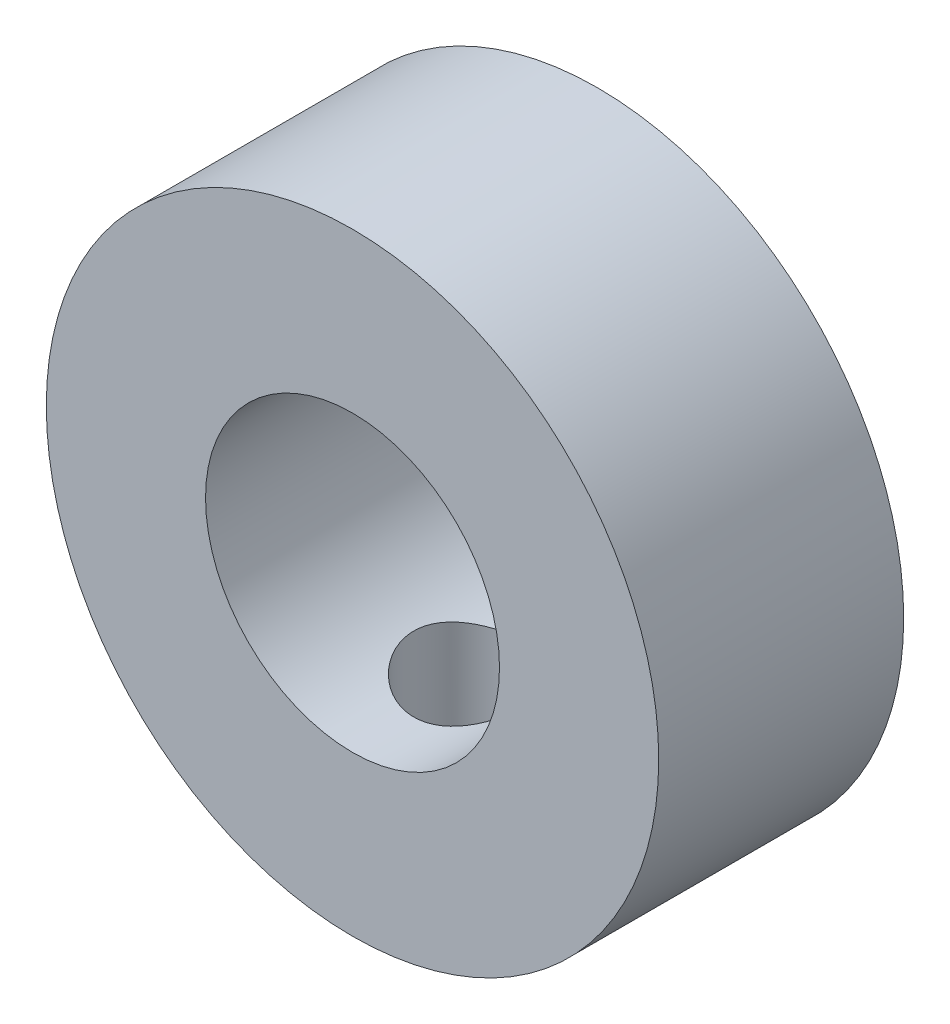
ISO-10303-21;
HEADER;
FILE_DESCRIPTION(('STEP AP214'),'2;1');
FILE_NAME('part.step','',(''),(''),'','','');
FILE_SCHEMA(('AUTOMOTIVE_DESIGN { 1 0 10303 214 1 1 1 1 }'));
ENDSEC;
DATA;
#1=APPLICATION_CONTEXT('core data for automotive mechanical design processes');
#2=APPLICATION_PROTOCOL_DEFINITION('international standard','automotive_design',2000,#1);
#3=PRODUCT_CONTEXT('',#1,'mechanical');
#4=PRODUCT('Part','Part','',(#3));
#5=PRODUCT_RELATED_PRODUCT_CATEGORY('part','',(#4));
#6=PRODUCT_DEFINITION_FORMATION('','',#4);
#7=PRODUCT_DEFINITION_CONTEXT('part definition',#1,'design');
#8=PRODUCT_DEFINITION('design','',#6,#7);
#9=PRODUCT_DEFINITION_SHAPE('','',#8);
#10=(LENGTH_UNIT() NAMED_UNIT(*) SI_UNIT(.MILLI.,.METRE.));
#11=(NAMED_UNIT(*) PLANE_ANGLE_UNIT() SI_UNIT($,.RADIAN.));
#12=(NAMED_UNIT(*) SI_UNIT($,.STERADIAN.) SOLID_ANGLE_UNIT());
#13=UNCERTAINTY_MEASURE_WITH_UNIT(LENGTH_MEASURE(1.E-05),#10,'distance_accuracy_value','');
#14=(GEOMETRIC_REPRESENTATION_CONTEXT(3) GLOBAL_UNCERTAINTY_ASSIGNED_CONTEXT((#13)) GLOBAL_UNIT_ASSIGNED_CONTEXT((#10,
#11,#12)) REPRESENTATION_CONTEXT('',''));
#15=CARTESIAN_POINT('',(0.,0.,0.));
#16=DIRECTION('',(0.,0.,1.));
#17=DIRECTION('',(1.,0.,0.));
#18=AXIS2_PLACEMENT_3D('',#15,#16,#17);
#19=CARTESIAN_POINT('',(0.,0.,10.));
#20=DIRECTION('',(0.,0.,-1.));
#21=DIRECTION('',(-1.,0.,0.));
#22=AXIS2_PLACEMENT_3D('',#19,#20,#21);
#23=CYLINDRICAL_SURFACE('',#22,12.5);
#24=CARTESIAN_POINT('',(0.,0.,10.));
#25=DIRECTION('',(0.,0.,1.));
#26=DIRECTION('',(1.,0.,0.));
#27=AXIS2_PLACEMENT_3D('',#24,#25,#26);
#28=CIRCLE('',#27,12.5);
#29=CARTESIAN_POINT('',(12.5,0.,10.));
#30=VERTEX_POINT('',#29);
#31=EDGE_CURVE('E10',#30,#30,#28,.T.);
#32=ORIENTED_EDGE('',*,*,#31,.F.);
#33=EDGE_LOOP('',(#32));
#34=FACE_BOUND('',#33,.T.);
#35=CARTESIAN_POINT('',(0.,0.,0.));
#36=DIRECTION('',(0.,0.,1.));
#37=DIRECTION('',(1.,0.,0.));
#38=AXIS2_PLACEMENT_3D('',#35,#36,#37);
#39=CIRCLE('',#38,12.5);
#40=CARTESIAN_POINT('',(12.5,0.,0.));
#41=VERTEX_POINT('',#40);
#42=EDGE_CURVE('E45',#41,#41,#39,.T.);
#43=ORIENTED_EDGE('',*,*,#42,.T.);
#44=EDGE_LOOP('',(#43));
#45=FACE_BOUND('',#44,.T.);
#46=CARTESIAN_POINT('',(0.,-12.5,2.5));
#47=CARTESIAN_POINT('',(0.138942266981583,-12.4999974395218,2.50000511124586));
#48=CARTESIAN_POINT('',(0.277949150503806,-12.4976596294558,2.51162210741911));
#49=CARTESIAN_POINT('',(0.552033769222548,-12.4885591405808,2.55774625028811));
#50=CARTESIAN_POINT('',(0.68710829385339,-12.4817929465047,2.59227158200377));
#51=CARTESIAN_POINT('',(0.949325763158282,-12.4645912319572,2.68310318405197));
#52=CARTESIAN_POINT('',(1.07647616983284,-12.454159226918,2.73938859211172));
#53=CARTESIAN_POINT('',(1.31951997216056,-12.4307599508829,2.87208061877824));
#54=CARTESIAN_POINT('',(1.43541403768953,-12.4177928308927,2.94848603901801));
#55=CARTESIAN_POINT('',(1.65423369328716,-12.3905541332492,3.12034623572859));
#56=CARTESIAN_POINT('',(1.75698487789631,-12.3762686376087,3.21602088847801));
#57=CARTESIAN_POINT('',(1.94509189152007,-12.3481045113147,3.42323104097926));
#58=CARTESIAN_POINT('',(2.03044636192606,-12.3342259125106,3.5347677783378));
#59=CARTESIAN_POINT('',(2.18207938336905,-12.3083110453154,3.77179048252969));
#60=CARTESIAN_POINT('',(2.24817734716467,-12.2962926841237,3.8973941094909));
#61=CARTESIAN_POINT('',(2.35826416645077,-12.2756567014604,4.1582045475102));
#62=CARTESIAN_POINT('',(2.40225520609309,-12.267038744049,4.29341040836586));
#63=CARTESIAN_POINT('',(2.46631324971207,-12.2543201313051,4.56771090976979));
#64=CARTESIAN_POINT('',(2.48668624489694,-12.2501617526797,4.70673136035557));
#65=CARTESIAN_POINT('',(2.5038803193153,-12.2466593765157,4.98627455341086));
#66=CARTESIAN_POINT('',(2.50070380678375,-12.247314886696,5.12679714080036));
#67=CARTESIAN_POINT('',(2.47113643275455,-12.2533137787046,5.40311697005251));
#68=CARTESIAN_POINT('',(2.44509635060976,-12.2585863214691,5.53895351406829));
#69=CARTESIAN_POINT('',(2.37109471155763,-12.273113654,5.80429019165751));
#70=CARTESIAN_POINT('',(2.3231321077517,-12.2823686339445,5.93379002229752));
#71=CARTESIAN_POINT('',(2.2063119591868,-12.3038904625102,6.183788154259));
#72=CARTESIAN_POINT('',(2.13731537808029,-12.3161772453426,6.30421969892293));
#73=CARTESIAN_POINT('',(1.9804839364317,-12.3423654693265,6.53192712493203));
#74=CARTESIAN_POINT('',(1.89264691089207,-12.3562670959591,6.63920149212789));
#75=CARTESIAN_POINT('',(1.69874983640146,-12.3844255310365,6.83957350614234));
#76=CARTESIAN_POINT('',(1.59239040303111,-12.3986842302726,6.93238141964783));
#77=CARTESIAN_POINT('',(1.36546256015502,-12.4257212178602,7.09888461575306));
#78=CARTESIAN_POINT('',(1.24489396844847,-12.4384994872243,7.17257965323395));
#79=CARTESIAN_POINT('',(0.992648467197302,-12.4611672540222,7.29881877306494));
#80=CARTESIAN_POINT('',(0.86095454896325,-12.4710522212068,7.35132973411134));
#81=CARTESIAN_POINT('',(0.590372441121662,-12.4867852246965,7.43340118509642));
#82=CARTESIAN_POINT('',(0.451485125181123,-12.4926337500133,7.46296445518407));
#83=CARTESIAN_POINT('',(0.172948514067876,-12.4995667966717,7.49789113448569));
#84=CARTESIAN_POINT('',(0.0333508208139404,-12.5007293663117,7.50365104885067));
#85=CARTESIAN_POINT('',(-0.244812335481785,-12.4983762982526,7.49187535264455));
#86=CARTESIAN_POINT('',(-0.383377856109483,-12.4948609235362,7.47434105161851));
#87=CARTESIAN_POINT('',(-0.654264149866353,-12.4835958002004,7.41680406614011));
#88=CARTESIAN_POINT('',(-0.786629870849758,-12.4758844101052,7.37700482875524));
#89=CARTESIAN_POINT('',(-1.04280906874917,-12.4570888015258,7.27629004336048));
#90=CARTESIAN_POINT('',(-1.16662190409385,-12.4460043303557,7.21537291330793));
#91=CARTESIAN_POINT('',(-1.40385293421554,-12.4214977883324,7.07329377337172));
#92=CARTESIAN_POINT('',(-1.51712531688047,-12.4080487609263,6.99189304740264));
#93=CARTESIAN_POINT('',(-1.72854504779802,-12.3803683707471,6.8114770219818));
#94=CARTESIAN_POINT('',(-1.82669077232691,-12.3661369242097,6.71245983400033));
#95=CARTESIAN_POINT('',(-2.00660147693544,-12.3382325889241,6.49781662027219));
#96=CARTESIAN_POINT('',(-2.08809425612164,-12.3245715058326,6.38196063944666));
#97=CARTESIAN_POINT('',(-2.23046355012802,-12.2996047949049,6.1379715966083));
#98=CARTESIAN_POINT('',(-2.29134088980726,-12.2882990728336,6.00983902606612));
#99=CARTESIAN_POINT('',(-2.3903796039549,-12.2694185146096,5.74557938462613));
#100=CARTESIAN_POINT('',(-2.42865874947763,-12.2618243718047,5.6094978969742));
#101=CARTESIAN_POINT('',(-2.48177162906799,-12.2511859198006,5.33266636627274));
#102=CARTESIAN_POINT('',(-2.49660842056278,-12.2481410172778,5.19191693447663));
#103=CARTESIAN_POINT('',(-2.50230227716867,-12.2469787407845,4.9124778386392));
#104=CARTESIAN_POINT('',(-2.49358947017724,-12.2487729797325,4.77379712768248));
#105=CARTESIAN_POINT('',(-2.45338076025015,-12.2568893371153,4.49992087523743));
#106=CARTESIAN_POINT('',(-2.42188504032325,-12.2632114191792,4.36472530576299));
#107=CARTESIAN_POINT('',(-2.33719642124739,-12.279631605479,4.10193072189864));
#108=CARTESIAN_POINT('',(-2.28405626679336,-12.2897205254708,3.97431409874396));
#109=CARTESIAN_POINT('',(-2.15763661150401,-12.3125428743543,3.7297406981639));
#110=CARTESIAN_POINT('',(-2.08435542193721,-12.3252765249724,3.61278481568716));
#111=CARTESIAN_POINT('',(-1.91826478696604,-12.3522240130806,3.39071106962421));
#112=CARTESIAN_POINT('',(-1.82514471808795,-12.3664593227425,3.28582808683101));
#113=CARTESIAN_POINT('',(-1.62266092253285,-12.3946520467989,3.09303448617707));
#114=CARTESIAN_POINT('',(-1.51329346788334,-12.4086093965796,3.00512777420682));
#115=CARTESIAN_POINT('',(-1.28004407272062,-12.4348458096993,2.84791339013388));
#116=CARTESIAN_POINT('',(-1.15602221107459,-12.4471057804812,2.77880999179994));
#117=CARTESIAN_POINT('',(-0.897915902351831,-12.468378127125,2.66253469350852));
#118=CARTESIAN_POINT('',(-0.763840652157815,-12.4773934284654,2.61534302616877));
#119=CARTESIAN_POINT('',(-0.524553722309448,-12.4894093148843,2.55337012988821));
#120=CARTESIAN_POINT('',(-0.420704160034461,-12.4933575789613,2.53339201573061));
#121=CARTESIAN_POINT('',(-0.211248813025167,-12.4986538534973,2.50670521910409));
#122=CARTESIAN_POINT('',(-0.105643084371547,-12.5000019468289,2.49999611372558));
#123=CARTESIAN_POINT('',(0.,-12.5,2.5));
#124=B_SPLINE_CURVE_WITH_KNOTS('',3,(#46,#47,#48,#49,#50,#51,#52,#53,#54,#55,#56,#57,#58,#59,
#60,#61,#62,#63,#64,#65,#66,#67,#68,#69,#70,#71,#72,#73,#74,#75,#76,#77,#78,#79,#80,#81,#82,#83,
#84,#85,#86,#87,#88,#89,#90,#91,#92,#93,#94,#95,#96,#97,#98,#99,#100,#101,#102,#103,#104,#105,
#106,#107,#108,#109,#110,#111,#112,#113,#114,#115,#116,#117,#118,#119,#120,#121,#122,#123),
.UNSPECIFIED.,.T.,.F.,(4,2,2,2,2,2,2,2,2,2,2,2,2,2,2,2,2,2,2,2,2,2,2,2,2,2,2,2,2,2,2,2,2,2,2,2,
2,2,4),(0.,0.416440326653146,0.833211626728308,1.24958433812585,1.66593225557716,
2.08733167528047,2.50876399186842,2.93402987514807,3.35925373412994,3.77890462758968,
4.19851260703063,4.61179317515696,5.02509348134324,5.44118725508982,5.85732886874176,
6.28095631228377,6.70458918849551,7.1288818713506,7.5531231424509,7.97026839190663,
8.38739019144669,8.80076134876809,9.21416348040056,9.63262665083397,10.0511347086483,
10.4760157144806,10.9008797180867,11.3235095258181,11.7460842082604,12.1609930641925,
12.5758985873152,12.9897990313278,13.4037341895467,13.8247019059786,14.2457663633233,
14.6712374168909,15.096323887938,15.4129693822474,15.7296047842749),.UNSPECIFIED.);
#125=CARTESIAN_POINT('',(0.,-12.5,2.5));
#126=VERTEX_POINT('',#125);
#127=EDGE_CURVE('E74',#126,#126,#124,.T.);
#128=ORIENTED_EDGE('',*,*,#127,.F.);
#129=EDGE_LOOP('',(#128));
#130=FACE_BOUND('',#129,.T.);
#131=ADVANCED_FACE('F33',(#34,#45,#130),#23,.T.);
#132=CARTESIAN_POINT('',(0.,0.,10.));
#133=DIRECTION('',(0.,0.,-1.));
#134=DIRECTION('',(-1.,0.,0.));
#135=AXIS2_PLACEMENT_3D('',#132,#133,#134);
#136=CYLINDRICAL_SURFACE('',#135,6.);
#137=CARTESIAN_POINT('',(0.,-6.,2.5));
#138=CARTESIAN_POINT('',(0.133903918163791,-5.99999628290906,2.5000047121396));
#139=CARTESIAN_POINT('',(0.268039524991424,-5.99546656821164,2.51082131560053));
#140=CARTESIAN_POINT('',(0.532498019991114,-5.97780115788617,2.55368073809363));
#141=CARTESIAN_POINT('',(0.66281002980867,-5.96464300599791,2.58577894678152));
#142=CARTESIAN_POINT('',(0.915376593299225,-5.93112629106012,2.6698214880593));
#143=CARTESIAN_POINT('',(1.03765681434384,-5.91079213642029,2.72169859232309));
#144=CARTESIAN_POINT('',(1.27165974779733,-5.8649055925345,2.84354583302186));
#145=CARTESIAN_POINT('',(1.38338564416287,-5.83935478441347,2.91351048897476));
#146=CARTESIAN_POINT('',(1.59889674004597,-5.78415660619864,3.07325791180754));
#147=CARTESIAN_POINT('',(1.70208251703042,-5.75437507703432,3.1638026032517));
#148=CARTESIAN_POINT('',(1.8923196601971,-5.69465427085228,3.36052868390046));
#149=CARTESIAN_POINT('',(1.9793625312399,-5.66471491925558,3.46671825371509));
#150=CARTESIAN_POINT('',(2.13907474876483,-5.60642043928224,3.69805355101054));
#151=CARTESIAN_POINT('',(2.2108261616941,-5.57821573827599,3.82387489575143));
#152=CARTESIAN_POINT('',(2.331878813161,-5.52871144633222,4.08714651694294));
#153=CARTESIAN_POINT('',(2.38119161708799,-5.50740829980501,4.22459075925711));
#154=CARTESIAN_POINT('',(2.45349196589845,-5.47557110795537,4.50030738326152));
#155=CARTESIAN_POINT('',(2.47763315746001,-5.46456775308951,4.63822096671102));
#156=CARTESIAN_POINT('',(2.50250419944798,-5.45322652433633,4.91654658544639));
#157=CARTESIAN_POINT('',(2.5032469611117,-5.45288276849132,5.05695720007038));
#158=CARTESIAN_POINT('',(2.48216900725155,-5.46250239122985,5.32480012085243));
#159=CARTESIAN_POINT('',(2.46207362224014,-5.47167765447589,5.45240219312424));
#160=CARTESIAN_POINT('',(2.40278382032142,-5.49796965547249,5.70222418200546));
#161=CARTESIAN_POINT('',(2.36358574574513,-5.51508791407034,5.82444306298481));
#162=CARTESIAN_POINT('',(2.2664391745498,-5.55572369545608,6.06311540598159));
#163=CARTESIAN_POINT('',(2.20810943078429,-5.57936963898298,6.17939084182641));
#164=CARTESIAN_POINT('',(2.07462485161169,-5.63036662282146,6.40095546776064));
#165=CARTESIAN_POINT('',(1.99946338103921,-5.65771912259552,6.50624030122713));
#166=CARTESIAN_POINT('',(1.82699193108754,-5.71585953755966,6.71219991746557));
#167=CARTESIAN_POINT('',(1.72834696641502,-5.74674242808947,6.81173313477085));
#168=CARTESIAN_POINT('',(1.51545918210306,-5.80651346225056,6.99322700591839));
#169=CARTESIAN_POINT('',(1.40121271889692,-5.83540113754019,7.07518354338437));
#170=CARTESIAN_POINT('',(1.15689589738674,-5.88876567112946,7.22087164723253));
#171=CARTESIAN_POINT('',(1.02652116489536,-5.91312533086667,7.28413889030136));
#172=CARTESIAN_POINT('',(0.755704805053668,-5.95378962829606,7.38744227920652));
#173=CARTESIAN_POINT('',(0.615268789590072,-5.970098716916,7.42749126388763));
#174=CARTESIAN_POINT('',(0.337856226692456,-5.9919928237277,7.48083198425327));
#175=CARTESIAN_POINT('',(0.201222570557279,-5.9981908209425,7.4956557148875));
#176=CARTESIAN_POINT('',(-0.0727093109921771,-6.00112100737489,7.50269244722819));
#177=CARTESIAN_POINT('',(-0.21000733430527,-5.99785591423878,7.494911940504));
#178=CARTESIAN_POINT('',(-0.47419648468287,-5.9826243531388,7.45805783038787));
#179=CARTESIAN_POINT('',(-0.601265933278775,-5.97109774567979,7.43006009180561));
#180=CARTESIAN_POINT('',(-0.848765497942178,-5.94097213544829,7.35506361091843));
#181=CARTESIAN_POINT('',(-0.969194773036713,-5.92237223919408,7.30806246809939));
#182=CARTESIAN_POINT('',(-1.20421799973828,-5.87916541290331,7.19485804857577));
#183=CARTESIAN_POINT('',(-1.31851447371068,-5.85438982938561,7.12810363370796));
#184=CARTESIAN_POINT('',(-1.53469243246282,-5.80147609158182,6.97789324441658));
#185=CARTESIAN_POINT('',(-1.63656870520375,-5.77333653537473,6.89443029694135));
#186=CARTESIAN_POINT('',(-1.83266686054867,-5.71424175790867,6.70619353345529));
#187=CARTESIAN_POINT('',(-1.92582139596023,-5.68322903182028,6.60032299402789));
#188=CARTESIAN_POINT('',(-2.09333969221046,-5.6236867353604,6.3739574481288));
#189=CARTESIAN_POINT('',(-2.16769918571027,-5.59515772986987,6.25345912965498));
#190=CARTESIAN_POINT('',(-2.2963192041761,-5.54362772487864,5.99877164939642));
#191=CARTESIAN_POINT('',(-2.35027836475451,-5.52071125109802,5.86441192897626));
#192=CARTESIAN_POINT('',(-2.43434827902353,-5.48416711318334,5.58725881237388));
#193=CARTESIAN_POINT('',(-2.46447869724417,-5.47053179113073,5.44447247501124));
#194=CARTESIAN_POINT('',(-2.49808160700532,-5.45526329073079,5.16636260162194));
#195=CARTESIAN_POINT('',(-2.50342760836084,-5.45278701929113,5.03131067548805));
#196=CARTESIAN_POINT('',(-2.49231151038001,-5.45787706027259,4.76231427764452));
#197=CARTESIAN_POINT('',(-2.47585275892879,-5.46544183100007,4.6283696390999));
#198=CARTESIAN_POINT('',(-2.42316809595844,-5.48899102586044,4.37181450532224));
#199=CARTESIAN_POINT('',(-2.38789807270203,-5.50456709625453,4.24896665402247));
#200=CARTESIAN_POINT('',(-2.29952656276963,-5.54206362465904,4.01090395633603));
#201=CARTESIAN_POINT('',(-2.24642006560089,-5.56398586515028,3.89569126566399));
#202=CARTESIAN_POINT('',(-2.1202057237392,-5.61333908853253,3.66860821185295));
#203=CARTESIAN_POINT('',(-2.04608723750136,-5.64102204404079,3.55735535405219));
#204=CARTESIAN_POINT('',(-1.88136812596239,-5.69807379131314,3.34827970688487));
#205=CARTESIAN_POINT('',(-1.79076178563715,-5.72744316520043,3.25046159496759));
#206=CARTESIAN_POINT('',(-1.58780416898838,-5.78712781593092,3.06370269438247));
#207=CARTESIAN_POINT('',(-1.47434977868814,-5.81735619175009,2.9759273571722));
#208=CARTESIAN_POINT('',(-1.23319985958043,-5.87320303099821,2.82060086995789));
#209=CARTESIAN_POINT('',(-1.1054978774169,-5.89881939160172,2.75305893600317));
#210=CARTESIAN_POINT('',(-0.841465213422195,-5.94218308378895,2.6415811295484));
#211=CARTESIAN_POINT('',(-0.705312056415868,-5.96005349044659,2.59727350570992));
#212=CARTESIAN_POINT('',(-0.426816782070269,-5.9864223497589,2.53258431247041));
#213=CARTESIAN_POINT('',(-0.284495506121991,-5.99495014042422,2.51212783179419));
#214=CARTESIAN_POINT('',(-0.118052512349439,-5.99888566614291,2.50267615821379));
#215=CARTESIAN_POINT('',(-0.0944569348794039,-5.99930292614997,2.50167339749698));
#216=CARTESIAN_POINT('',(-0.0472433090693369,-5.99986042138656,2.50033490174322));
#217=CARTESIAN_POINT('',(-0.0236252606651509,-6.0000006558228,2.49999916861636));
#218=CARTESIAN_POINT('',(0.,-6.,2.5));
#219=B_SPLINE_CURVE_WITH_KNOTS('',3,(#137,#138,#139,#140,#141,#142,#143,#144,#145,#146,#147,
#148,#149,#150,#151,#152,#153,#154,#155,#156,#157,#158,#159,#160,#161,#162,#163,#164,#165,#166,
#167,#168,#169,#170,#171,#172,#173,#174,#175,#176,#177,#178,#179,#180,#181,#182,#183,#184,#185,
#186,#187,#188,#189,#190,#191,#192,#193,#194,#195,#196,#197,#198,#199,#200,#201,#202,#203,#204,
#205,#206,#207,#208,#209,#210,#211,#212,#213,#214,#215,#216,#217,#218),.UNSPECIFIED.,.T.,.F.,(4,
2,2,2,2,2,2,2,2,2,2,2,2,2,2,2,2,2,2,2,2,2,2,2,2,2,2,2,2,2,2,2,2,2,2,2,2,2,2,2,4),(0.,
0.401613837767878,0.804277081257393,1.2055837038126,1.60676887370595,2.02635872577614,
2.44616876262931,2.88663449078251,3.32687293461176,3.74590546275116,4.16470676498093,
4.55140314405113,4.93817359454425,5.33317426117429,5.72833091434413,6.15688282255793,
6.58553498629176,7.02408110121627,7.46238448436595,7.87296886786503,8.28343534986344,
8.67353179471443,9.06367753203571,9.46594270544323,9.86837610938992,10.2995697605859,
10.7308612248068,11.1682957671905,11.6053689414916,12.0087975511929,12.4121642259507,
12.7967529992953,13.1814498990123,13.5892778679488,13.9972474685189,14.4349307000978,
14.8728129885717,15.3034571163877,15.7327450093864,15.8036033125922,15.8744618187069),.UNSPECIFIED.);
#220=CARTESIAN_POINT('',(0.,-6.,2.5));
#221=VERTEX_POINT('',#220);
#222=EDGE_CURVE('E55',#221,#221,#219,.T.);
#223=ORIENTED_EDGE('',*,*,#222,.T.);
#224=EDGE_LOOP('',(#223));
#225=FACE_BOUND('',#224,.T.);
#226=CARTESIAN_POINT('',(0.,0.,10.));
#227=DIRECTION('',(0.,0.,1.));
#228=DIRECTION('',(1.,0.,0.));
#229=AXIS2_PLACEMENT_3D('',#226,#227,#228);
#230=CIRCLE('',#229,6.);
#231=CARTESIAN_POINT('',(6.,0.,10.));
#232=VERTEX_POINT('',#231);
#233=EDGE_CURVE('E50',#232,#232,#230,.T.);
#234=ORIENTED_EDGE('',*,*,#233,.T.);
#235=EDGE_LOOP('',(#234));
#236=FACE_BOUND('',#235,.T.);
#237=CARTESIAN_POINT('',(0.,0.,0.));
#238=DIRECTION('',(0.,0.,1.));
#239=DIRECTION('',(1.,0.,0.));
#240=AXIS2_PLACEMENT_3D('',#237,#238,#239);
#241=CIRCLE('',#240,6.);
#242=CARTESIAN_POINT('',(6.,0.,0.));
#243=VERTEX_POINT('',#242);
#244=EDGE_CURVE('E53',#243,#243,#241,.T.);
#245=ORIENTED_EDGE('',*,*,#244,.F.);
#246=EDGE_LOOP('',(#245));
#247=FACE_BOUND('',#246,.T.);
#248=CARTESIAN_POINT('',(0.,6.,2.5));
#249=CARTESIAN_POINT('',(-0.133903918163791,5.99999628290906,2.5000047121396));
#250=CARTESIAN_POINT('',(-0.268039524991424,5.99546656821164,2.51082131560053));
#251=CARTESIAN_POINT('',(-0.532498019991114,5.97780115788617,2.55368073809363));
#252=CARTESIAN_POINT('',(-0.66281002980867,5.96464300599791,2.58577894678152));
#253=CARTESIAN_POINT('',(-0.915376593299225,5.93112629106012,2.6698214880593));
#254=CARTESIAN_POINT('',(-1.03765681434384,5.91079213642029,2.72169859232309));
#255=CARTESIAN_POINT('',(-1.27165974779733,5.8649055925345,2.84354583302186));
#256=CARTESIAN_POINT('',(-1.38338564416287,5.83935478441347,2.91351048897476));
#257=CARTESIAN_POINT('',(-1.59889674004597,5.78415660619864,3.07325791180754));
#258=CARTESIAN_POINT('',(-1.70208251703042,5.75437507703432,3.1638026032517));
#259=CARTESIAN_POINT('',(-1.8923196601971,5.69465427085228,3.36052868390046));
#260=CARTESIAN_POINT('',(-1.9793625312399,5.66471491925558,3.46671825371509));
#261=CARTESIAN_POINT('',(-2.13907474876483,5.60642043928224,3.69805355101054));
#262=CARTESIAN_POINT('',(-2.2108261616941,5.57821573827599,3.82387489575143));
#263=CARTESIAN_POINT('',(-2.331878813161,5.52871144633222,4.08714651694294));
#264=CARTESIAN_POINT('',(-2.38119161708799,5.50740829980501,4.22459075925711));
#265=CARTESIAN_POINT('',(-2.45349196589845,5.47557110795537,4.50030738326152));
#266=CARTESIAN_POINT('',(-2.47763315746001,5.46456775308951,4.63822096671102));
#267=CARTESIAN_POINT('',(-2.50250419944798,5.45322652433633,4.91654658544639));
#268=CARTESIAN_POINT('',(-2.5032469611117,5.45288276849132,5.05695720007038));
#269=CARTESIAN_POINT('',(-2.48216900725155,5.46250239122985,5.32480012085243));
#270=CARTESIAN_POINT('',(-2.46207362224014,5.47167765447589,5.45240219312424));
#271=CARTESIAN_POINT('',(-2.40278382032142,5.49796965547249,5.70222418200546));
#272=CARTESIAN_POINT('',(-2.36358574574513,5.51508791407034,5.82444306298481));
#273=CARTESIAN_POINT('',(-2.2664391745498,5.55572369545608,6.06311540598159));
#274=CARTESIAN_POINT('',(-2.20810943078429,5.57936963898298,6.17939084182641));
#275=CARTESIAN_POINT('',(-2.07462485161169,5.63036662282146,6.40095546776064));
#276=CARTESIAN_POINT('',(-1.99946338103921,5.65771912259552,6.50624030122713));
#277=CARTESIAN_POINT('',(-1.82699193108754,5.71585953755966,6.71219991746557));
#278=CARTESIAN_POINT('',(-1.72834696641502,5.74674242808947,6.81173313477085));
#279=CARTESIAN_POINT('',(-1.51545918210306,5.80651346225056,6.99322700591839));
#280=CARTESIAN_POINT('',(-1.40121271889692,5.83540113754019,7.07518354338437));
#281=CARTESIAN_POINT('',(-1.15689589738674,5.88876567112946,7.22087164723253));
#282=CARTESIAN_POINT('',(-1.02652116489536,5.91312533086667,7.28413889030136));
#283=CARTESIAN_POINT('',(-0.755704805053668,5.95378962829606,7.38744227920652));
#284=CARTESIAN_POINT('',(-0.615268789590072,5.970098716916,7.42749126388763));
#285=CARTESIAN_POINT('',(-0.337856226692456,5.9919928237277,7.48083198425327));
#286=CARTESIAN_POINT('',(-0.201222570557279,5.9981908209425,7.4956557148875));
#287=CARTESIAN_POINT('',(0.0727093109921771,6.00112100737489,7.50269244722819));
#288=CARTESIAN_POINT('',(0.21000733430527,5.99785591423878,7.494911940504));
#289=CARTESIAN_POINT('',(0.47419648468287,5.9826243531388,7.45805783038787));
#290=CARTESIAN_POINT('',(0.601265933278775,5.97109774567979,7.43006009180561));
#291=CARTESIAN_POINT('',(0.848765497942178,5.94097213544829,7.35506361091843));
#292=CARTESIAN_POINT('',(0.969194773036713,5.92237223919408,7.30806246809939));
#293=CARTESIAN_POINT('',(1.20421799973828,5.87916541290331,7.19485804857577));
#294=CARTESIAN_POINT('',(1.31851447371068,5.85438982938561,7.12810363370796));
#295=CARTESIAN_POINT('',(1.53469243246282,5.80147609158182,6.97789324441658));
#296=CARTESIAN_POINT('',(1.63656870520375,5.77333653537473,6.89443029694135));
#297=CARTESIAN_POINT('',(1.83266686054867,5.71424175790867,6.70619353345529));
#298=CARTESIAN_POINT('',(1.92582139596023,5.68322903182028,6.60032299402789));
#299=CARTESIAN_POINT('',(2.09333969221046,5.6236867353604,6.3739574481288));
#300=CARTESIAN_POINT('',(2.16769918571027,5.59515772986987,6.25345912965498));
#301=CARTESIAN_POINT('',(2.2963192041761,5.54362772487864,5.99877164939642));
#302=CARTESIAN_POINT('',(2.35027836475451,5.52071125109802,5.86441192897626));
#303=CARTESIAN_POINT('',(2.43434827902353,5.48416711318334,5.58725881237388));
#304=CARTESIAN_POINT('',(2.46447869724417,5.47053179113073,5.44447247501124));
#305=CARTESIAN_POINT('',(2.49808160700532,5.45526329073079,5.16636260162194));
#306=CARTESIAN_POINT('',(2.50342760836084,5.45278701929113,5.03131067548805));
#307=CARTESIAN_POINT('',(2.49231151038001,5.45787706027259,4.76231427764452));
#308=CARTESIAN_POINT('',(2.47585275892879,5.46544183100007,4.6283696390999));
#309=CARTESIAN_POINT('',(2.42316809595844,5.48899102586044,4.37181450532224));
#310=CARTESIAN_POINT('',(2.38789807270203,5.50456709625453,4.24896665402247));
#311=CARTESIAN_POINT('',(2.29952656276963,5.54206362465904,4.01090395633603));
#312=CARTESIAN_POINT('',(2.24642006560089,5.56398586515028,3.89569126566399));
#313=CARTESIAN_POINT('',(2.1202057237392,5.61333908853253,3.66860821185295));
#314=CARTESIAN_POINT('',(2.04608723750136,5.64102204404079,3.55735535405219));
#315=CARTESIAN_POINT('',(1.88136812596239,5.69807379131314,3.34827970688487));
#316=CARTESIAN_POINT('',(1.79076178563715,5.72744316520043,3.25046159496759));
#317=CARTESIAN_POINT('',(1.58780416898838,5.78712781593092,3.06370269438247));
#318=CARTESIAN_POINT('',(1.47434977868814,5.81735619175009,2.9759273571722));
#319=CARTESIAN_POINT('',(1.23319985958043,5.87320303099821,2.82060086995789));
#320=CARTESIAN_POINT('',(1.1054978774169,5.89881939160172,2.75305893600317));
#321=CARTESIAN_POINT('',(0.841465213422195,5.94218308378895,2.6415811295484));
#322=CARTESIAN_POINT('',(0.705312056415868,5.96005349044659,2.59727350570992));
#323=CARTESIAN_POINT('',(0.426816782070269,5.9864223497589,2.53258431247041));
#324=CARTESIAN_POINT('',(0.284495506121991,5.99495014042422,2.51212783179419));
#325=CARTESIAN_POINT('',(0.118052512349439,5.99888566614291,2.50267615821379));
#326=CARTESIAN_POINT('',(0.0944569348794039,5.99930292614997,2.50167339749698));
#327=CARTESIAN_POINT('',(0.0472433090693369,5.99986042138656,2.50033490174322));
#328=CARTESIAN_POINT('',(0.0236252606651509,6.0000006558228,2.49999916861636));
#329=CARTESIAN_POINT('',(0.,6.,2.5));
#330=B_SPLINE_CURVE_WITH_KNOTS('',3,(#248,#249,#250,#251,#252,#253,#254,#255,#256,#257,#258,
#259,#260,#261,#262,#263,#264,#265,#266,#267,#268,#269,#270,#271,#272,#273,#274,#275,#276,#277,
#278,#279,#280,#281,#282,#283,#284,#285,#286,#287,#288,#289,#290,#291,#292,#293,#294,#295,#296,
#297,#298,#299,#300,#301,#302,#303,#304,#305,#306,#307,#308,#309,#310,#311,#312,#313,#314,#315,
#316,#317,#318,#319,#320,#321,#322,#323,#324,#325,#326,#327,#328,#329),.UNSPECIFIED.,.T.,.F.,(4,
2,2,2,2,2,2,2,2,2,2,2,2,2,2,2,2,2,2,2,2,2,2,2,2,2,2,2,2,2,2,2,2,2,2,2,2,2,2,2,4),(0.,
0.401613837767878,0.804277081257393,1.2055837038126,1.60676887370595,2.02635872577614,
2.44616876262931,2.88663449078251,3.32687293461176,3.74590546275116,4.16470676498093,
4.55140314405113,4.93817359454425,5.33317426117429,5.72833091434413,6.15688282255793,
6.58553498629176,7.02408110121627,7.46238448436595,7.87296886786503,8.28343534986344,
8.67353179471443,9.06367753203571,9.46594270544323,9.86837610938992,10.2995697605859,
10.7308612248068,11.1682957671905,11.6053689414916,12.0087975511929,12.4121642259507,
12.7967529992953,13.1814498990123,13.5892778679488,13.9972474685189,14.4349307000978,
14.8728129885717,15.3034571163877,15.7327450093864,15.8036033125922,15.8744618187069),.UNSPECIFIED.);
#331=CARTESIAN_POINT('',(0.,6.,2.5));
#332=VERTEX_POINT('',#331);
#333=EDGE_CURVE('E37',#332,#332,#330,.T.);
#334=ORIENTED_EDGE('',*,*,#333,.T.);
#335=EDGE_LOOP('',(#334));
#336=FACE_BOUND('',#335,.T.);
#337=ADVANCED_FACE('F60',(#225,#236,#247,#336),#136,.F.);
#338=CARTESIAN_POINT('',(0.,0.,10.));
#339=DIRECTION('',(0.,0.,1.));
#340=DIRECTION('',(1.,0.,0.));
#341=AXIS2_PLACEMENT_3D('',#338,#339,#340);
#342=PLANE('',#341);
#343=ORIENTED_EDGE('',*,*,#31,.T.);
#344=EDGE_LOOP('',(#343));
#345=FACE_BOUND('',#344,.T.);
#346=ORIENTED_EDGE('',*,*,#233,.F.);
#347=EDGE_LOOP('',(#346));
#348=FACE_BOUND('',#347,.T.);
#349=ADVANCED_FACE('F88',(#345,#348),#342,.T.);
#350=CARTESIAN_POINT('',(0.,0.,0.));
#351=DIRECTION('',(0.,0.,1.));
#352=DIRECTION('',(1.,0.,0.));
#353=AXIS2_PLACEMENT_3D('',#350,#351,#352);
#354=PLANE('',#353);
#355=ORIENTED_EDGE('',*,*,#42,.F.);
#356=EDGE_LOOP('',(#355));
#357=FACE_BOUND('',#356,.T.);
#358=ORIENTED_EDGE('',*,*,#244,.T.);
#359=EDGE_LOOP('',(#358));
#360=FACE_BOUND('',#359,.T.);
#361=ADVANCED_FACE('F68',(#357,#360),#354,.F.);
#362=CARTESIAN_POINT('',(0.,10.,5.));
#363=DIRECTION('',(0.,-1.,0.));
#364=DIRECTION('',(0.,0.,-1.));
#365=AXIS2_PLACEMENT_3D('',#362,#363,#364);
#366=CYLINDRICAL_SURFACE('',#365,2.5);
#367=ORIENTED_EDGE('',*,*,#222,.F.);
#368=EDGE_LOOP('',(#367));
#369=FACE_BOUND('',#368,.T.);
#370=ORIENTED_EDGE('',*,*,#127,.T.);
#371=EDGE_LOOP('',(#370));
#372=FACE_BOUND('',#371,.T.);
#373=ADVANCED_FACE('F63',(#369,#372),#366,.F.);
#374=ORIENTED_EDGE('',*,*,#333,.F.);
#375=EDGE_LOOP('',(#374));
#376=FACE_BOUND('',#375,.T.);
#377=CARTESIAN_POINT('',(0.,10.,5.));
#378=DIRECTION('',(0.,1.,0.));
#379=DIRECTION('',(0.,0.,1.));
#380=AXIS2_PLACEMENT_3D('',#377,#378,#379);
#381=CIRCLE('',#380,2.5);
#382=CARTESIAN_POINT('',(0.,10.,7.5));
#383=VERTEX_POINT('',#382);
#384=EDGE_CURVE('E59',#383,#383,#381,.T.);
#385=ORIENTED_EDGE('',*,*,#384,.T.);
#386=EDGE_LOOP('',(#385));
#387=FACE_BOUND('',#386,.T.);
#388=ADVANCED_FACE('F67',(#376,#387),#366,.F.);
#389=CARTESIAN_POINT('',(0.,10.,5.));
#390=DIRECTION('',(0.,1.,0.));
#391=DIRECTION('',(0.,0.,1.));
#392=AXIS2_PLACEMENT_3D('',#389,#390,#391);
#393=PLANE('',#392);
#394=ORIENTED_EDGE('',*,*,#384,.F.);
#395=EDGE_LOOP('',(#394));
#396=FACE_BOUND('',#395,.T.);
#397=ADVANCED_FACE('F70',(#396),#393,.F.);
#398=CLOSED_SHELL('',(#131,#337,#349,#361,#373,#388,#397));
#399=MANIFOLD_SOLID_BREP('B2',#398);
#400=ADVANCED_BREP_SHAPE_REPRESENTATION('',(#18,#399),#14);
#401=SHAPE_DEFINITION_REPRESENTATION(#9,#400);
ENDSEC;
END-ISO-10303-21;
